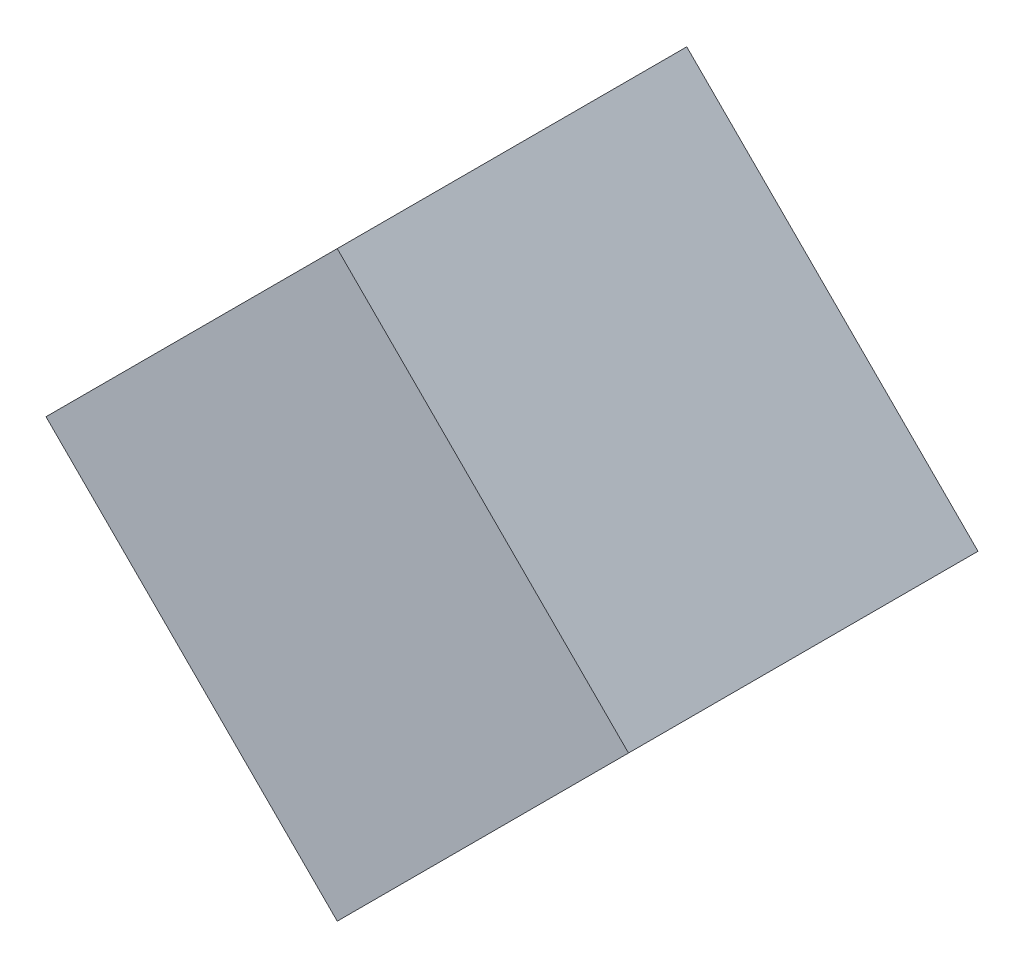
ISO-10303-21;
HEADER;
FILE_DESCRIPTION(('STEP AP214'),'2;1');
FILE_NAME('part.step','',(''),(''),'','','');
FILE_SCHEMA(('AUTOMOTIVE_DESIGN { 1 0 10303 214 1 1 1 1 }'));
ENDSEC;
DATA;
#1=APPLICATION_CONTEXT('core data for automotive mechanical design processes');
#2=APPLICATION_PROTOCOL_DEFINITION('international standard','automotive_design',2000,#1);
#3=PRODUCT_CONTEXT('',#1,'mechanical');
#4=PRODUCT('Part','Part','',(#3));
#5=PRODUCT_RELATED_PRODUCT_CATEGORY('part','',(#4));
#6=PRODUCT_DEFINITION_FORMATION('','',#4);
#7=PRODUCT_DEFINITION_CONTEXT('part definition',#1,'design');
#8=PRODUCT_DEFINITION('design','',#6,#7);
#9=PRODUCT_DEFINITION_SHAPE('','',#8);
#10=(LENGTH_UNIT() NAMED_UNIT(*) SI_UNIT(.MILLI.,.METRE.));
#11=(NAMED_UNIT(*) PLANE_ANGLE_UNIT() SI_UNIT($,.RADIAN.));
#12=(NAMED_UNIT(*) SI_UNIT($,.STERADIAN.) SOLID_ANGLE_UNIT());
#13=UNCERTAINTY_MEASURE_WITH_UNIT(LENGTH_MEASURE(1.E-05),#10,'distance_accuracy_value','');
#14=(GEOMETRIC_REPRESENTATION_CONTEXT(3) GLOBAL_UNCERTAINTY_ASSIGNED_CONTEXT((#13)) GLOBAL_UNIT_ASSIGNED_CONTEXT((#10,
#11,#12)) REPRESENTATION_CONTEXT('',''));
#15=CARTESIAN_POINT('',(0.,0.,0.));
#16=DIRECTION('',(0.,0.,1.));
#17=DIRECTION('',(1.,0.,0.));
#18=AXIS2_PLACEMENT_3D('',#15,#16,#17);
#19=CARTESIAN_POINT('',(0.,-25.,30.));
#20=DIRECTION('',(-0.707106781186548,0.707106781186547,0.));
#21=DIRECTION('',(-0.707106781186547,-0.707106781186548,0.));
#22=AXIS2_PLACEMENT_3D('',#19,#20,#21);
#23=PLANE('',#22);
#24=DIRECTION('',(0.707106781186547,0.707106781186548,0.));
#25=VECTOR('',#24,1.);
#26=CARTESIAN_POINT('',(0.,-25.,0.));
#27=LINE('',#26,#25);
#28=CARTESIAN_POINT('',(0.,-25.,0.));
#29=VERTEX_POINT('',#28);
#30=CARTESIAN_POINT('',(25.,0.,0.));
#31=VERTEX_POINT('',#30);
#32=EDGE_CURVE('E96',#29,#31,#27,.T.);
#33=ORIENTED_EDGE('',*,*,#32,.T.);
#34=DIRECTION('',(0.,0.,-1.));
#35=VECTOR('',#34,1.);
#36=CARTESIAN_POINT('',(25.,0.,30.));
#37=LINE('',#36,#35);
#38=CARTESIAN_POINT('',(25.,0.,30.));
#39=VERTEX_POINT('',#38);
#40=EDGE_CURVE('E11',#39,#31,#37,.T.);
#41=ORIENTED_EDGE('',*,*,#40,.F.);
#42=DIRECTION('',(0.707106781186547,0.707106781186548,0.));
#43=VECTOR('',#42,1.);
#44=CARTESIAN_POINT('',(0.,-25.,30.));
#45=LINE('',#44,#43);
#46=CARTESIAN_POINT('',(0.,-25.,30.));
#47=VERTEX_POINT('',#46);
#48=EDGE_CURVE('E84',#47,#39,#45,.T.);
#49=ORIENTED_EDGE('',*,*,#48,.F.);
#50=DIRECTION('',(0.,0.,-1.));
#51=VECTOR('',#50,1.);
#52=CARTESIAN_POINT('',(0.,-25.,30.));
#53=LINE('',#52,#51);
#54=EDGE_CURVE('E92',#47,#29,#53,.T.);
#55=ORIENTED_EDGE('',*,*,#54,.T.);
#56=EDGE_LOOP('',(#33,#41,#49,#55));
#57=FACE_BOUND('',#56,.T.);
#58=ADVANCED_FACE('F33',(#57),#23,.F.);
#59=CARTESIAN_POINT('',(25.,0.,30.));
#60=DIRECTION('',(-0.707106781186547,-0.707106781186547,0.));
#61=DIRECTION('',(0.707106781186548,-0.707106781186548,0.));
#62=AXIS2_PLACEMENT_3D('',#59,#60,#61);
#63=PLANE('',#62);
#64=DIRECTION('',(-0.707106781186548,0.707106781186548,0.));
#65=VECTOR('',#64,1.);
#66=CARTESIAN_POINT('',(25.,0.,0.));
#67=LINE('',#66,#65);
#68=CARTESIAN_POINT('',(0.,25.,0.));
#69=VERTEX_POINT('',#68);
#70=EDGE_CURVE('E88',#31,#69,#67,.T.);
#71=ORIENTED_EDGE('',*,*,#70,.T.);
#72=DIRECTION('',(0.,0.,-1.));
#73=VECTOR('',#72,1.);
#74=CARTESIAN_POINT('',(0.,25.,30.));
#75=LINE('',#74,#73);
#76=CARTESIAN_POINT('',(0.,25.,30.));
#77=VERTEX_POINT('',#76);
#78=EDGE_CURVE('E41',#77,#69,#75,.T.);
#79=ORIENTED_EDGE('',*,*,#78,.F.);
#80=DIRECTION('',(-0.707106781186548,0.707106781186548,0.));
#81=VECTOR('',#80,1.);
#82=CARTESIAN_POINT('',(25.,0.,30.));
#83=LINE('',#82,#81);
#84=EDGE_CURVE('E79',#39,#77,#83,.T.);
#85=ORIENTED_EDGE('',*,*,#84,.F.);
#86=ORIENTED_EDGE('',*,*,#40,.T.);
#87=EDGE_LOOP('',(#71,#79,#85,#86));
#88=FACE_BOUND('',#87,.T.);
#89=ADVANCED_FACE('F87',(#88),#63,.F.);
#90=CARTESIAN_POINT('',(0.,25.,30.));
#91=DIRECTION('',(0.707106781186548,-0.707106781186547,0.));
#92=DIRECTION('',(0.707106781186547,0.707106781186548,0.));
#93=AXIS2_PLACEMENT_3D('',#90,#91,#92);
#94=PLANE('',#93);
#95=DIRECTION('',(-0.707106781186547,-0.707106781186548,0.));
#96=VECTOR('',#95,1.);
#97=CARTESIAN_POINT('',(0.,25.,0.));
#98=LINE('',#97,#96);
#99=CARTESIAN_POINT('',(-25.,0.,0.));
#100=VERTEX_POINT('',#99);
#101=EDGE_CURVE('E66',#69,#100,#98,.T.);
#102=ORIENTED_EDGE('',*,*,#101,.T.);
#103=DIRECTION('',(0.,0.,-1.));
#104=VECTOR('',#103,1.);
#105=CARTESIAN_POINT('',(-25.,0.,30.));
#106=LINE('',#105,#104);
#107=CARTESIAN_POINT('',(-25.,0.,30.));
#108=VERTEX_POINT('',#107);
#109=EDGE_CURVE('E89',#108,#100,#106,.T.);
#110=ORIENTED_EDGE('',*,*,#109,.F.);
#111=DIRECTION('',(-0.707106781186547,-0.707106781186548,0.));
#112=VECTOR('',#111,1.);
#113=CARTESIAN_POINT('',(0.,25.,30.));
#114=LINE('',#113,#112);
#115=EDGE_CURVE('E82',#77,#108,#114,.T.);
#116=ORIENTED_EDGE('',*,*,#115,.F.);
#117=ORIENTED_EDGE('',*,*,#78,.T.);
#118=EDGE_LOOP('',(#102,#110,#116,#117));
#119=FACE_BOUND('',#118,.T.);
#120=ADVANCED_FACE('F90',(#119),#94,.F.);
#121=CARTESIAN_POINT('',(-25.,0.,30.));
#122=DIRECTION('',(0.707106781186547,0.707106781186548,0.));
#123=DIRECTION('',(-0.707106781186548,0.707106781186547,0.));
#124=AXIS2_PLACEMENT_3D('',#121,#122,#123);
#125=PLANE('',#124);
#126=DIRECTION('',(0.707106781186548,-0.707106781186547,0.));
#127=VECTOR('',#126,1.);
#128=CARTESIAN_POINT('',(-25.,0.,0.));
#129=LINE('',#128,#127);
#130=EDGE_CURVE('E72',#100,#29,#129,.T.);
#131=ORIENTED_EDGE('',*,*,#130,.T.);
#132=ORIENTED_EDGE('',*,*,#54,.F.);
#133=DIRECTION('',(0.707106781186548,-0.707106781186547,0.));
#134=VECTOR('',#133,1.);
#135=CARTESIAN_POINT('',(-25.,0.,30.));
#136=LINE('',#135,#134);
#137=EDGE_CURVE('E49',#108,#47,#136,.T.);
#138=ORIENTED_EDGE('',*,*,#137,.F.);
#139=ORIENTED_EDGE('',*,*,#109,.T.);
#140=EDGE_LOOP('',(#131,#132,#138,#139));
#141=FACE_BOUND('',#140,.T.);
#142=ADVANCED_FACE('F103',(#141),#125,.F.);
#143=CARTESIAN_POINT('',(0.,0.,30.));
#144=DIRECTION('',(0.,0.,1.));
#145=DIRECTION('',(1.,0.,0.));
#146=AXIS2_PLACEMENT_3D('',#143,#144,#145);
#147=PLANE('',#146);
#148=ORIENTED_EDGE('',*,*,#48,.T.);
#149=ORIENTED_EDGE('',*,*,#84,.T.);
#150=ORIENTED_EDGE('',*,*,#115,.T.);
#151=ORIENTED_EDGE('',*,*,#137,.T.);
#152=EDGE_LOOP('',(#148,#149,#150,#151));
#153=FACE_BOUND('',#152,.T.);
#154=ADVANCED_FACE('F80',(#153),#147,.T.);
#155=CARTESIAN_POINT('',(0.,0.,0.));
#156=DIRECTION('',(0.,0.,1.));
#157=DIRECTION('',(1.,0.,0.));
#158=AXIS2_PLACEMENT_3D('',#155,#156,#157);
#159=PLANE('',#158);
#160=ORIENTED_EDGE('',*,*,#32,.F.);
#161=ORIENTED_EDGE('',*,*,#130,.F.);
#162=ORIENTED_EDGE('',*,*,#101,.F.);
#163=ORIENTED_EDGE('',*,*,#70,.F.);
#164=EDGE_LOOP('',(#160,#161,#162,#163));
#165=FACE_BOUND('',#164,.T.);
#166=ADVANCED_FACE('F106',(#165),#159,.F.);
#167=CLOSED_SHELL('',(#58,#89,#120,#142,#154,#166));
#168=MANIFOLD_SOLID_BREP('B2',#167);
#169=ADVANCED_BREP_SHAPE_REPRESENTATION('',(#18,#168),#14);
#170=SHAPE_DEFINITION_REPRESENTATION(#9,#169);
ENDSEC;
END-ISO-10303-21;
